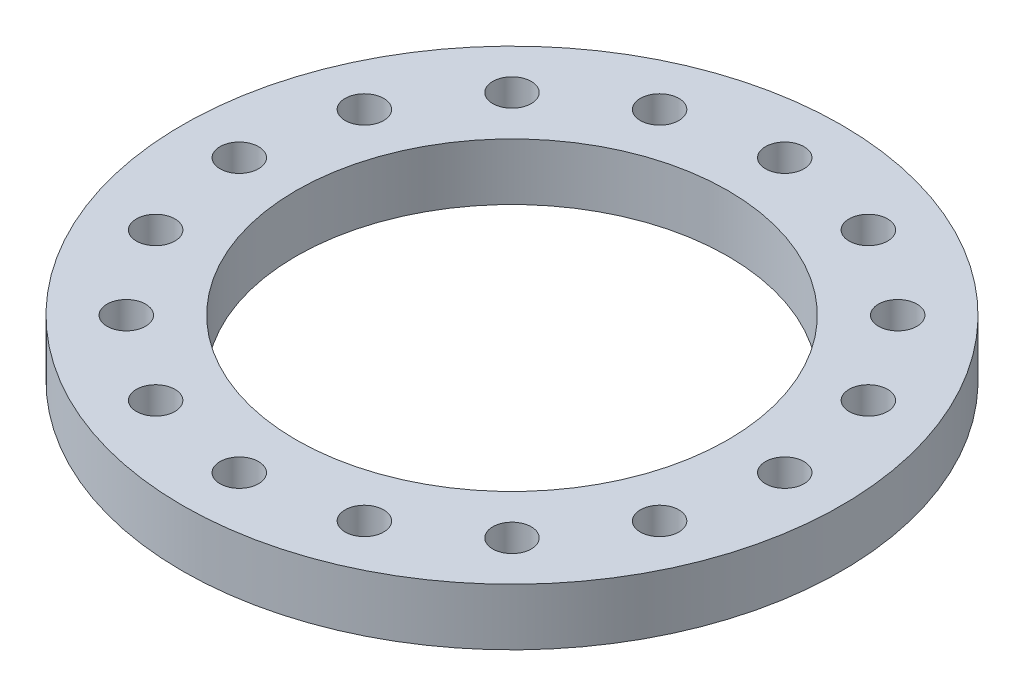
ISO-10303-21;
HEADER;
FILE_DESCRIPTION(('STEP AP214'),'2;1');
FILE_NAME('part.step','',(''),(''),'','','');
FILE_SCHEMA(('AUTOMOTIVE_DESIGN { 1 0 10303 214 1 1 1 1 }'));
ENDSEC;
DATA;
#1=APPLICATION_CONTEXT('core data for automotive mechanical design processes');
#2=APPLICATION_PROTOCOL_DEFINITION('international standard','automotive_design',2000,#1);
#3=PRODUCT_CONTEXT('',#1,'mechanical');
#4=PRODUCT('Part','Part','',(#3));
#5=PRODUCT_RELATED_PRODUCT_CATEGORY('part','',(#4));
#6=PRODUCT_DEFINITION_FORMATION('','',#4);
#7=PRODUCT_DEFINITION_CONTEXT('part definition',#1,'design');
#8=PRODUCT_DEFINITION('design','',#6,#7);
#9=PRODUCT_DEFINITION_SHAPE('','',#8);
#10=(LENGTH_UNIT() NAMED_UNIT(*) SI_UNIT(.MILLI.,.METRE.));
#11=(NAMED_UNIT(*) PLANE_ANGLE_UNIT() SI_UNIT($,.RADIAN.));
#12=(NAMED_UNIT(*) SI_UNIT($,.STERADIAN.) SOLID_ANGLE_UNIT());
#13=UNCERTAINTY_MEASURE_WITH_UNIT(LENGTH_MEASURE(1.E-05),#10,'distance_accuracy_value','');
#14=(GEOMETRIC_REPRESENTATION_CONTEXT(3) GLOBAL_UNCERTAINTY_ASSIGNED_CONTEXT((#13)) GLOBAL_UNIT_ASSIGNED_CONTEXT((#10,
#11,#12)) REPRESENTATION_CONTEXT('',''));
#15=CARTESIAN_POINT('',(0.,0.,0.));
#16=DIRECTION('',(0.,0.,1.));
#17=DIRECTION('',(1.,0.,0.));
#18=AXIS2_PLACEMENT_3D('',#15,#16,#17);
#19=CARTESIAN_POINT('',(0.,6.35,0.));
#20=DIRECTION('',(0.,1.,0.));
#21=DIRECTION('',(0.,0.,1.));
#22=AXIS2_PLACEMENT_3D('',#19,#20,#21);
#23=PLANE('',#22);
#24=CARTESIAN_POINT('',(-21.5526146905656,6.35,-21.5526146905651));
#25=DIRECTION('',(0.,1.,0.));
#26=DIRECTION('',(0.,0.,1.));
#27=AXIS2_PLACEMENT_3D('',#24,#25,#26);
#28=CIRCLE('',#27,2.15265);
#29=CARTESIAN_POINT('',(-21.5526146905656,6.35,-19.3999646905651));
#30=VERTEX_POINT('',#29);
#31=EDGE_CURVE('E133',#30,#30,#28,.T.);
#32=ORIENTED_EDGE('',*,*,#31,.F.);
#33=EDGE_LOOP('',(#32));
#34=FACE_BOUND('',#33,.T.);
#35=CARTESIAN_POINT('',(-30.4799999999987,6.35,1.29757419343617E-12));
#36=DIRECTION('',(0.,1.,0.));
#37=DIRECTION('',(0.,0.,1.));
#38=AXIS2_PLACEMENT_3D('',#35,#36,#37);
#39=CIRCLE('',#38,2.15265);
#40=CARTESIAN_POINT('',(-30.4799999999987,6.35,2.1526500000013));
#41=VERTEX_POINT('',#40);
#42=EDGE_CURVE('E121',#41,#41,#39,.T.);
#43=ORIENTED_EDGE('',*,*,#42,.F.);
#44=EDGE_LOOP('',(#43));
#45=FACE_BOUND('',#44,.T.);
#46=CARTESIAN_POINT('',(-21.5526146905638,6.35,21.5526146905669));
#47=DIRECTION('',(0.,1.,0.));
#48=DIRECTION('',(0.,0.,1.));
#49=AXIS2_PLACEMENT_3D('',#46,#47,#48);
#50=CIRCLE('',#49,2.15265);
#51=CARTESIAN_POINT('',(-21.5526146905638,6.35,23.7052646905669));
#52=VERTEX_POINT('',#51);
#53=EDGE_CURVE('E109',#52,#52,#50,.T.);
#54=ORIENTED_EDGE('',*,*,#53,.F.);
#55=EDGE_LOOP('',(#54));
#56=FACE_BOUND('',#55,.T.);
#57=CARTESIAN_POINT('',(2.5884605907022E-12,6.35,30.48));
#58=DIRECTION('',(0.,1.,0.));
#59=DIRECTION('',(0.,0.,1.));
#60=AXIS2_PLACEMENT_3D('',#57,#58,#59);
#61=CIRCLE('',#60,2.15265);
#62=CARTESIAN_POINT('',(2.5884605907022E-12,6.35,32.63265));
#63=VERTEX_POINT('',#62);
#64=EDGE_CURVE('E97',#63,#63,#61,.T.);
#65=ORIENTED_EDGE('',*,*,#64,.F.);
#66=EDGE_LOOP('',(#65));
#67=FACE_BOUND('',#66,.T.);
#68=CARTESIAN_POINT('',(21.5526146905682,6.35,21.5526146905651));
#69=DIRECTION('',(0.,1.,0.));
#70=DIRECTION('',(0.,0.,1.));
#71=AXIS2_PLACEMENT_3D('',#68,#69,#70);
#72=CIRCLE('',#71,2.15265);
#73=CARTESIAN_POINT('',(21.5526146905682,6.35,23.7052646905651));
#74=VERTEX_POINT('',#73);
#75=EDGE_CURVE('E85',#74,#74,#72,.T.);
#76=ORIENTED_EDGE('',*,*,#75,.F.);
#77=EDGE_LOOP('',(#76));
#78=FACE_BOUND('',#77,.T.);
#79=CARTESIAN_POINT('',(30.4800000000013,6.35,-1.29384146999237E-12));
#80=DIRECTION('',(0.,1.,0.));
#81=DIRECTION('',(0.,0.,1.));
#82=AXIS2_PLACEMENT_3D('',#79,#80,#81);
#83=CIRCLE('',#82,2.15265);
#84=CARTESIAN_POINT('',(30.4800000000013,6.35,2.15264999999871));
#85=VERTEX_POINT('',#84);
#86=EDGE_CURVE('E73',#85,#85,#83,.T.);
#87=ORIENTED_EDGE('',*,*,#86,.F.);
#88=EDGE_LOOP('',(#87));
#89=FACE_BOUND('',#88,.T.);
#90=CARTESIAN_POINT('',(21.5526146905664,6.35,-21.5526146905669));
#91=DIRECTION('',(0.,1.,0.));
#92=DIRECTION('',(0.,0.,1.));
#93=AXIS2_PLACEMENT_3D('',#90,#91,#92);
#94=CIRCLE('',#93,2.15265);
#95=CARTESIAN_POINT('',(21.5526146905664,6.35,-19.3999646905669));
#96=VERTEX_POINT('',#95);
#97=EDGE_CURVE('E61',#96,#96,#94,.T.);
#98=ORIENTED_EDGE('',*,*,#97,.F.);
#99=EDGE_LOOP('',(#98));
#100=FACE_BOUND('',#99,.T.);
#101=CARTESIAN_POINT('',(0.,6.35,-30.48));
#102=DIRECTION('',(0.,1.,0.));
#103=DIRECTION('',(0.,0.,1.));
#104=AXIS2_PLACEMENT_3D('',#101,#102,#103);
#105=CIRCLE('',#104,2.15265);
#106=CARTESIAN_POINT('',(0.,6.35,-28.32735));
#107=VERTEX_POINT('',#106);
#108=EDGE_CURVE('E49',#107,#107,#105,.T.);
#109=ORIENTED_EDGE('',*,*,#108,.F.);
#110=EDGE_LOOP('',(#109));
#111=FACE_BOUND('',#110,.T.);
#112=CARTESIAN_POINT('',(0.,6.35,0.));
#113=DIRECTION('',(0.,1.,0.));
#114=DIRECTION('',(0.,0.,1.));
#115=AXIS2_PLACEMENT_3D('',#112,#113,#114);
#116=CIRCLE('',#115,36.83);
#117=CARTESIAN_POINT('',(0.,6.35,36.83));
#118=VERTEX_POINT('',#117);
#119=EDGE_CURVE('E10',#118,#118,#116,.T.);
#120=ORIENTED_EDGE('',*,*,#119,.T.);
#121=EDGE_LOOP('',(#120));
#122=FACE_BOUND('',#121,.T.);
#123=CARTESIAN_POINT('',(0.,6.35,0.));
#124=DIRECTION('',(0.,1.,0.));
#125=DIRECTION('',(0.,0.,1.));
#126=AXIS2_PLACEMENT_3D('',#123,#124,#125);
#127=CIRCLE('',#126,24.13);
#128=CARTESIAN_POINT('',(0.,6.35,24.13));
#129=VERTEX_POINT('',#128);
#130=EDGE_CURVE('E44',#129,#129,#127,.T.);
#131=ORIENTED_EDGE('',*,*,#130,.F.);
#132=EDGE_LOOP('',(#131));
#133=FACE_BOUND('',#132,.T.);
#134=CARTESIAN_POINT('',(11.664191018488,6.35,-28.159848150944));
#135=DIRECTION('',(0.,1.,0.));
#136=DIRECTION('',(0.,0.,1.));
#137=AXIS2_PLACEMENT_3D('',#134,#135,#136);
#138=CIRCLE('',#137,2.15265);
#139=CARTESIAN_POINT('',(11.664191018488,6.35,-26.007198150944));
#140=VERTEX_POINT('',#139);
#141=EDGE_CURVE('E55',#140,#140,#138,.T.);
#142=ORIENTED_EDGE('',*,*,#141,.F.);
#143=EDGE_LOOP('',(#142));
#144=FACE_BOUND('',#143,.T.);
#145=CARTESIAN_POINT('',(28.1598481509448,6.35,-11.6641910184891));
#146=DIRECTION('',(0.,1.,0.));
#147=DIRECTION('',(0.,0.,1.));
#148=AXIS2_PLACEMENT_3D('',#145,#146,#147);
#149=CIRCLE('',#148,2.15265);
#150=CARTESIAN_POINT('',(28.1598481509448,6.35,-9.51154101848913));
#151=VERTEX_POINT('',#150);
#152=EDGE_CURVE('E67',#151,#151,#149,.T.);
#153=ORIENTED_EDGE('',*,*,#152,.F.);
#154=EDGE_LOOP('',(#153));
#155=FACE_BOUND('',#154,.T.);
#156=CARTESIAN_POINT('',(28.1598481509458,6.35,11.6641910184867));
#157=DIRECTION('',(0.,1.,0.));
#158=DIRECTION('',(0.,0.,1.));
#159=AXIS2_PLACEMENT_3D('',#156,#157,#158);
#160=CIRCLE('',#159,2.15265);
#161=CARTESIAN_POINT('',(28.1598481509458,6.35,13.8168410184867));
#162=VERTEX_POINT('',#161);
#163=EDGE_CURVE('E79',#162,#162,#160,.T.);
#164=ORIENTED_EDGE('',*,*,#163,.F.);
#165=EDGE_LOOP('',(#164));
#166=FACE_BOUND('',#165,.T.);
#167=CARTESIAN_POINT('',(11.6641910184904,6.35,28.1598481509435));
#168=DIRECTION('',(0.,1.,0.));
#169=DIRECTION('',(0.,0.,1.));
#170=AXIS2_PLACEMENT_3D('',#167,#168,#169);
#171=CIRCLE('',#170,2.15265);
#172=CARTESIAN_POINT('',(11.6641910184904,6.35,30.3124981509435));
#173=VERTEX_POINT('',#172);
#174=EDGE_CURVE('E91',#173,#173,#171,.T.);
#175=ORIENTED_EDGE('',*,*,#174,.F.);
#176=EDGE_LOOP('',(#175));
#177=FACE_BOUND('',#176,.T.);
#178=CARTESIAN_POINT('',(-11.6641910184854,6.35,28.1598481509445));
#179=DIRECTION('',(0.,1.,0.));
#180=DIRECTION('',(0.,0.,1.));
#181=AXIS2_PLACEMENT_3D('',#178,#179,#180);
#182=CIRCLE('',#181,2.15265);
#183=CARTESIAN_POINT('',(-11.6641910184854,6.35,30.3124981509445));
#184=VERTEX_POINT('',#183);
#185=EDGE_CURVE('E103',#184,#184,#182,.T.);
#186=ORIENTED_EDGE('',*,*,#185,.F.);
#187=EDGE_LOOP('',(#186));
#188=FACE_BOUND('',#187,.T.);
#189=CARTESIAN_POINT('',(-28.1598481509422,6.35,11.6641910184891));
#190=DIRECTION('',(0.,1.,0.));
#191=DIRECTION('',(0.,0.,1.));
#192=AXIS2_PLACEMENT_3D('',#189,#190,#191);
#193=CIRCLE('',#192,2.15265);
#194=CARTESIAN_POINT('',(-28.1598481509422,6.35,13.8168410184891));
#195=VERTEX_POINT('',#194);
#196=EDGE_CURVE('E115',#195,#195,#193,.T.);
#197=ORIENTED_EDGE('',*,*,#196,.F.);
#198=EDGE_LOOP('',(#197));
#199=FACE_BOUND('',#198,.T.);
#200=CARTESIAN_POINT('',(-28.1598481509432,6.35,-11.6641910184867));
#201=DIRECTION('',(0.,1.,0.));
#202=DIRECTION('',(0.,0.,1.));
#203=AXIS2_PLACEMENT_3D('',#200,#201,#202);
#204=CIRCLE('',#203,2.15265);
#205=CARTESIAN_POINT('',(-28.1598481509432,6.35,-9.51154101848675));
#206=VERTEX_POINT('',#205);
#207=EDGE_CURVE('E127',#206,#206,#204,.T.);
#208=ORIENTED_EDGE('',*,*,#207,.F.);
#209=EDGE_LOOP('',(#208));
#210=FACE_BOUND('',#209,.T.);
#211=CARTESIAN_POINT('',(-11.6641910184879,6.35,-28.1598481509435));
#212=DIRECTION('',(0.,1.,0.));
#213=DIRECTION('',(0.,0.,1.));
#214=AXIS2_PLACEMENT_3D('',#211,#212,#213);
#215=CIRCLE('',#214,2.15265000000048);
#216=CARTESIAN_POINT('',(-11.6641910184879,6.35,-26.007198150943));
#217=VERTEX_POINT('',#216);
#218=EDGE_CURVE('E139',#217,#217,#215,.T.);
#219=ORIENTED_EDGE('',*,*,#218,.F.);
#220=EDGE_LOOP('',(#219));
#221=FACE_BOUND('',#220,.T.);
#222=ADVANCED_FACE('F33',(#34,#45,#56,#67,#78,#89,#100,#111,#122,#133,#144,#155,#166,#177,#188,
#199,#210,#221),#23,.T.);
#223=CARTESIAN_POINT('',(0.,0.,0.));
#224=DIRECTION('',(0.,1.,0.));
#225=DIRECTION('',(0.,0.,1.));
#226=AXIS2_PLACEMENT_3D('',#223,#224,#225);
#227=PLANE('',#226);
#228=CARTESIAN_POINT('',(0.,0.,0.));
#229=DIRECTION('',(0.,1.,0.));
#230=DIRECTION('',(0.,0.,1.));
#231=AXIS2_PLACEMENT_3D('',#228,#229,#230);
#232=CIRCLE('',#231,36.83);
#233=CARTESIAN_POINT('',(0.,0.,36.83));
#234=VERTEX_POINT('',#233);
#235=EDGE_CURVE('E37',#234,#234,#232,.T.);
#236=ORIENTED_EDGE('',*,*,#235,.F.);
#237=EDGE_LOOP('',(#236));
#238=FACE_BOUND('',#237,.T.);
#239=CARTESIAN_POINT('',(0.,0.,0.));
#240=DIRECTION('',(0.,1.,0.));
#241=DIRECTION('',(0.,0.,1.));
#242=AXIS2_PLACEMENT_3D('',#239,#240,#241);
#243=CIRCLE('',#242,24.13);
#244=CARTESIAN_POINT('',(0.,0.,24.13));
#245=VERTEX_POINT('',#244);
#246=EDGE_CURVE('E46',#245,#245,#243,.T.);
#247=ORIENTED_EDGE('',*,*,#246,.T.);
#248=EDGE_LOOP('',(#247));
#249=FACE_BOUND('',#248,.T.);
#250=CARTESIAN_POINT('',(0.,0.,-30.48));
#251=DIRECTION('',(0.,1.,0.));
#252=DIRECTION('',(0.,0.,1.));
#253=AXIS2_PLACEMENT_3D('',#250,#251,#252);
#254=CIRCLE('',#253,2.15265);
#255=CARTESIAN_POINT('',(0.,0.,-28.32735));
#256=VERTEX_POINT('',#255);
#257=EDGE_CURVE('E52',#256,#256,#254,.T.);
#258=ORIENTED_EDGE('',*,*,#257,.T.);
#259=EDGE_LOOP('',(#258));
#260=FACE_BOUND('',#259,.T.);
#261=CARTESIAN_POINT('',(11.664191018488,0.,-28.159848150944));
#262=DIRECTION('',(0.,1.,0.));
#263=DIRECTION('',(0.,0.,1.));
#264=AXIS2_PLACEMENT_3D('',#261,#262,#263);
#265=CIRCLE('',#264,2.15265);
#266=CARTESIAN_POINT('',(11.664191018488,0.,-26.007198150944));
#267=VERTEX_POINT('',#266);
#268=EDGE_CURVE('E58',#267,#267,#265,.T.);
#269=ORIENTED_EDGE('',*,*,#268,.T.);
#270=EDGE_LOOP('',(#269));
#271=FACE_BOUND('',#270,.T.);
#272=CARTESIAN_POINT('',(21.5526146905664,0.,-21.5526146905669));
#273=DIRECTION('',(0.,1.,0.));
#274=DIRECTION('',(0.,0.,1.));
#275=AXIS2_PLACEMENT_3D('',#272,#273,#274);
#276=CIRCLE('',#275,2.15265);
#277=CARTESIAN_POINT('',(21.5526146905664,0.,-19.3999646905669));
#278=VERTEX_POINT('',#277);
#279=EDGE_CURVE('E64',#278,#278,#276,.T.);
#280=ORIENTED_EDGE('',*,*,#279,.T.);
#281=EDGE_LOOP('',(#280));
#282=FACE_BOUND('',#281,.T.);
#283=CARTESIAN_POINT('',(28.1598481509448,0.,-11.6641910184891));
#284=DIRECTION('',(0.,1.,0.));
#285=DIRECTION('',(0.,0.,1.));
#286=AXIS2_PLACEMENT_3D('',#283,#284,#285);
#287=CIRCLE('',#286,2.15265);
#288=CARTESIAN_POINT('',(28.1598481509448,0.,-9.51154101848913));
#289=VERTEX_POINT('',#288);
#290=EDGE_CURVE('E70',#289,#289,#287,.T.);
#291=ORIENTED_EDGE('',*,*,#290,.T.);
#292=EDGE_LOOP('',(#291));
#293=FACE_BOUND('',#292,.T.);
#294=CARTESIAN_POINT('',(30.4800000000013,0.,-1.29384146999237E-12));
#295=DIRECTION('',(0.,1.,0.));
#296=DIRECTION('',(0.,0.,1.));
#297=AXIS2_PLACEMENT_3D('',#294,#295,#296);
#298=CIRCLE('',#297,2.15265);
#299=CARTESIAN_POINT('',(30.4800000000013,0.,2.15264999999871));
#300=VERTEX_POINT('',#299);
#301=EDGE_CURVE('E76',#300,#300,#298,.T.);
#302=ORIENTED_EDGE('',*,*,#301,.T.);
#303=EDGE_LOOP('',(#302));
#304=FACE_BOUND('',#303,.T.);
#305=CARTESIAN_POINT('',(28.1598481509458,0.,11.6641910184867));
#306=DIRECTION('',(0.,1.,0.));
#307=DIRECTION('',(0.,0.,1.));
#308=AXIS2_PLACEMENT_3D('',#305,#306,#307);
#309=CIRCLE('',#308,2.15265);
#310=CARTESIAN_POINT('',(28.1598481509458,0.,13.8168410184867));
#311=VERTEX_POINT('',#310);
#312=EDGE_CURVE('E82',#311,#311,#309,.T.);
#313=ORIENTED_EDGE('',*,*,#312,.T.);
#314=EDGE_LOOP('',(#313));
#315=FACE_BOUND('',#314,.T.);
#316=CARTESIAN_POINT('',(21.5526146905682,0.,21.5526146905651));
#317=DIRECTION('',(0.,1.,0.));
#318=DIRECTION('',(0.,0.,1.));
#319=AXIS2_PLACEMENT_3D('',#316,#317,#318);
#320=CIRCLE('',#319,2.15265);
#321=CARTESIAN_POINT('',(21.5526146905682,0.,23.7052646905651));
#322=VERTEX_POINT('',#321);
#323=EDGE_CURVE('E88',#322,#322,#320,.T.);
#324=ORIENTED_EDGE('',*,*,#323,.T.);
#325=EDGE_LOOP('',(#324));
#326=FACE_BOUND('',#325,.T.);
#327=CARTESIAN_POINT('',(11.6641910184904,0.,28.1598481509435));
#328=DIRECTION('',(0.,1.,0.));
#329=DIRECTION('',(0.,0.,1.));
#330=AXIS2_PLACEMENT_3D('',#327,#328,#329);
#331=CIRCLE('',#330,2.15265);
#332=CARTESIAN_POINT('',(11.6641910184904,0.,30.3124981509435));
#333=VERTEX_POINT('',#332);
#334=EDGE_CURVE('E94',#333,#333,#331,.T.);
#335=ORIENTED_EDGE('',*,*,#334,.T.);
#336=EDGE_LOOP('',(#335));
#337=FACE_BOUND('',#336,.T.);
#338=CARTESIAN_POINT('',(2.5884605907022E-12,0.,30.48));
#339=DIRECTION('',(0.,1.,0.));
#340=DIRECTION('',(0.,0.,1.));
#341=AXIS2_PLACEMENT_3D('',#338,#339,#340);
#342=CIRCLE('',#341,2.15265);
#343=CARTESIAN_POINT('',(2.5884605907022E-12,0.,32.63265));
#344=VERTEX_POINT('',#343);
#345=EDGE_CURVE('E100',#344,#344,#342,.T.);
#346=ORIENTED_EDGE('',*,*,#345,.T.);
#347=EDGE_LOOP('',(#346));
#348=FACE_BOUND('',#347,.T.);
#349=CARTESIAN_POINT('',(-11.6641910184854,0.,28.1598481509445));
#350=DIRECTION('',(0.,1.,0.));
#351=DIRECTION('',(0.,0.,1.));
#352=AXIS2_PLACEMENT_3D('',#349,#350,#351);
#353=CIRCLE('',#352,2.15265);
#354=CARTESIAN_POINT('',(-11.6641910184854,0.,30.3124981509445));
#355=VERTEX_POINT('',#354);
#356=EDGE_CURVE('E106',#355,#355,#353,.T.);
#357=ORIENTED_EDGE('',*,*,#356,.T.);
#358=EDGE_LOOP('',(#357));
#359=FACE_BOUND('',#358,.T.);
#360=CARTESIAN_POINT('',(-21.5526146905638,0.,21.5526146905669));
#361=DIRECTION('',(0.,1.,0.));
#362=DIRECTION('',(0.,0.,1.));
#363=AXIS2_PLACEMENT_3D('',#360,#361,#362);
#364=CIRCLE('',#363,2.15265);
#365=CARTESIAN_POINT('',(-21.5526146905638,0.,23.7052646905669));
#366=VERTEX_POINT('',#365);
#367=EDGE_CURVE('E112',#366,#366,#364,.T.);
#368=ORIENTED_EDGE('',*,*,#367,.T.);
#369=EDGE_LOOP('',(#368));
#370=FACE_BOUND('',#369,.T.);
#371=CARTESIAN_POINT('',(-28.1598481509422,0.,11.6641910184891));
#372=DIRECTION('',(0.,1.,0.));
#373=DIRECTION('',(0.,0.,1.));
#374=AXIS2_PLACEMENT_3D('',#371,#372,#373);
#375=CIRCLE('',#374,2.15265);
#376=CARTESIAN_POINT('',(-28.1598481509422,0.,13.8168410184891));
#377=VERTEX_POINT('',#376);
#378=EDGE_CURVE('E118',#377,#377,#375,.T.);
#379=ORIENTED_EDGE('',*,*,#378,.T.);
#380=EDGE_LOOP('',(#379));
#381=FACE_BOUND('',#380,.T.);
#382=CARTESIAN_POINT('',(-30.4799999999987,0.,1.29757419343617E-12));
#383=DIRECTION('',(0.,1.,0.));
#384=DIRECTION('',(0.,0.,1.));
#385=AXIS2_PLACEMENT_3D('',#382,#383,#384);
#386=CIRCLE('',#385,2.15265);
#387=CARTESIAN_POINT('',(-30.4799999999987,0.,2.1526500000013));
#388=VERTEX_POINT('',#387);
#389=EDGE_CURVE('E124',#388,#388,#386,.T.);
#390=ORIENTED_EDGE('',*,*,#389,.T.);
#391=EDGE_LOOP('',(#390));
#392=FACE_BOUND('',#391,.T.);
#393=CARTESIAN_POINT('',(-28.1598481509432,0.,-11.6641910184867));
#394=DIRECTION('',(0.,1.,0.));
#395=DIRECTION('',(0.,0.,1.));
#396=AXIS2_PLACEMENT_3D('',#393,#394,#395);
#397=CIRCLE('',#396,2.15265);
#398=CARTESIAN_POINT('',(-28.1598481509432,0.,-9.51154101848675));
#399=VERTEX_POINT('',#398);
#400=EDGE_CURVE('E130',#399,#399,#397,.T.);
#401=ORIENTED_EDGE('',*,*,#400,.T.);
#402=EDGE_LOOP('',(#401));
#403=FACE_BOUND('',#402,.T.);
#404=CARTESIAN_POINT('',(-21.5526146905656,0.,-21.5526146905651));
#405=DIRECTION('',(0.,1.,0.));
#406=DIRECTION('',(0.,0.,1.));
#407=AXIS2_PLACEMENT_3D('',#404,#405,#406);
#408=CIRCLE('',#407,2.15265);
#409=CARTESIAN_POINT('',(-21.5526146905656,0.,-19.3999646905651));
#410=VERTEX_POINT('',#409);
#411=EDGE_CURVE('E136',#410,#410,#408,.T.);
#412=ORIENTED_EDGE('',*,*,#411,.T.);
#413=EDGE_LOOP('',(#412));
#414=FACE_BOUND('',#413,.T.);
#415=CARTESIAN_POINT('',(-11.6641910184879,0.,-28.1598481509435));
#416=DIRECTION('',(0.,1.,0.));
#417=DIRECTION('',(0.,0.,1.));
#418=AXIS2_PLACEMENT_3D('',#415,#416,#417);
#419=CIRCLE('',#418,2.15265000000048);
#420=CARTESIAN_POINT('',(-11.6641910184879,0.,-26.007198150943));
#421=VERTEX_POINT('',#420);
#422=EDGE_CURVE('E142',#421,#421,#419,.T.);
#423=ORIENTED_EDGE('',*,*,#422,.T.);
#424=EDGE_LOOP('',(#423));
#425=FACE_BOUND('',#424,.T.);
#426=ADVANCED_FACE('F152',(#238,#249,#260,#271,#282,#293,#304,#315,#326,#337,#348,#359,#370,
#381,#392,#403,#414,#425),#227,.F.);
#427=CARTESIAN_POINT('',(0.,6.35,0.));
#428=DIRECTION('',(0.,-1.,0.));
#429=DIRECTION('',(0.,0.,-1.));
#430=AXIS2_PLACEMENT_3D('',#427,#428,#429);
#431=CYLINDRICAL_SURFACE('',#430,36.83);
#432=ORIENTED_EDGE('',*,*,#119,.F.);
#433=EDGE_LOOP('',(#432));
#434=FACE_BOUND('',#433,.T.);
#435=ORIENTED_EDGE('',*,*,#235,.T.);
#436=EDGE_LOOP('',(#435));
#437=FACE_BOUND('',#436,.T.);
#438=ADVANCED_FACE('F35',(#434,#437),#431,.T.);
#439=CARTESIAN_POINT('',(0.,6.35,0.));
#440=DIRECTION('',(0.,-1.,0.));
#441=DIRECTION('',(0.,0.,-1.));
#442=AXIS2_PLACEMENT_3D('',#439,#440,#441);
#443=CYLINDRICAL_SURFACE('',#442,24.13);
#444=ORIENTED_EDGE('',*,*,#130,.T.);
#445=EDGE_LOOP('',(#444));
#446=FACE_BOUND('',#445,.T.);
#447=ORIENTED_EDGE('',*,*,#246,.F.);
#448=EDGE_LOOP('',(#447));
#449=FACE_BOUND('',#448,.T.);
#450=ADVANCED_FACE('F162',(#446,#449),#443,.F.);
#451=CARTESIAN_POINT('',(0.,6.35,-30.48));
#452=DIRECTION('',(0.,-1.,0.));
#453=DIRECTION('',(0.,0.,-1.));
#454=AXIS2_PLACEMENT_3D('',#451,#452,#453);
#455=CYLINDRICAL_SURFACE('',#454,2.15265);
#456=ORIENTED_EDGE('',*,*,#108,.T.);
#457=EDGE_LOOP('',(#456));
#458=FACE_BOUND('',#457,.T.);
#459=ORIENTED_EDGE('',*,*,#257,.F.);
#460=EDGE_LOOP('',(#459));
#461=FACE_BOUND('',#460,.T.);
#462=ADVANCED_FACE('F165',(#458,#461),#455,.F.);
#463=CARTESIAN_POINT('',(11.664191018488,6.35,-28.159848150944));
#464=DIRECTION('',(0.,-1.,0.));
#465=DIRECTION('',(0.,0.,-1.));
#466=AXIS2_PLACEMENT_3D('',#463,#464,#465);
#467=CYLINDRICAL_SURFACE('',#466,2.15265);
#468=ORIENTED_EDGE('',*,*,#141,.T.);
#469=EDGE_LOOP('',(#468));
#470=FACE_BOUND('',#469,.T.);
#471=ORIENTED_EDGE('',*,*,#268,.F.);
#472=EDGE_LOOP('',(#471));
#473=FACE_BOUND('',#472,.T.);
#474=ADVANCED_FACE('F169',(#470,#473),#467,.F.);
#475=CARTESIAN_POINT('',(21.5526146905664,6.35,-21.5526146905669));
#476=DIRECTION('',(0.,-1.,0.));
#477=DIRECTION('',(0.,0.,-1.));
#478=AXIS2_PLACEMENT_3D('',#475,#476,#477);
#479=CYLINDRICAL_SURFACE('',#478,2.15265);
#480=ORIENTED_EDGE('',*,*,#97,.T.);
#481=EDGE_LOOP('',(#480));
#482=FACE_BOUND('',#481,.T.);
#483=ORIENTED_EDGE('',*,*,#279,.F.);
#484=EDGE_LOOP('',(#483));
#485=FACE_BOUND('',#484,.T.);
#486=ADVANCED_FACE('F173',(#482,#485),#479,.F.);
#487=CARTESIAN_POINT('',(28.1598481509448,6.35,-11.6641910184891));
#488=DIRECTION('',(0.,-1.,0.));
#489=DIRECTION('',(0.,0.,-1.));
#490=AXIS2_PLACEMENT_3D('',#487,#488,#489);
#491=CYLINDRICAL_SURFACE('',#490,2.15265);
#492=ORIENTED_EDGE('',*,*,#152,.T.);
#493=EDGE_LOOP('',(#492));
#494=FACE_BOUND('',#493,.T.);
#495=ORIENTED_EDGE('',*,*,#290,.F.);
#496=EDGE_LOOP('',(#495));
#497=FACE_BOUND('',#496,.T.);
#498=ADVANCED_FACE('F177',(#494,#497),#491,.F.);
#499=CARTESIAN_POINT('',(30.4800000000013,6.35,-1.29384146999237E-12));
#500=DIRECTION('',(0.,-1.,0.));
#501=DIRECTION('',(0.,0.,-1.));
#502=AXIS2_PLACEMENT_3D('',#499,#500,#501);
#503=CYLINDRICAL_SURFACE('',#502,2.15265);
#504=ORIENTED_EDGE('',*,*,#86,.T.);
#505=EDGE_LOOP('',(#504));
#506=FACE_BOUND('',#505,.T.);
#507=ORIENTED_EDGE('',*,*,#301,.F.);
#508=EDGE_LOOP('',(#507));
#509=FACE_BOUND('',#508,.T.);
#510=ADVANCED_FACE('F181',(#506,#509),#503,.F.);
#511=CARTESIAN_POINT('',(28.1598481509458,6.35,11.6641910184867));
#512=DIRECTION('',(0.,-1.,0.));
#513=DIRECTION('',(0.,0.,-1.));
#514=AXIS2_PLACEMENT_3D('',#511,#512,#513);
#515=CYLINDRICAL_SURFACE('',#514,2.15265);
#516=ORIENTED_EDGE('',*,*,#163,.T.);
#517=EDGE_LOOP('',(#516));
#518=FACE_BOUND('',#517,.T.);
#519=ORIENTED_EDGE('',*,*,#312,.F.);
#520=EDGE_LOOP('',(#519));
#521=FACE_BOUND('',#520,.T.);
#522=ADVANCED_FACE('F185',(#518,#521),#515,.F.);
#523=CARTESIAN_POINT('',(21.5526146905682,6.35,21.5526146905651));
#524=DIRECTION('',(0.,-1.,0.));
#525=DIRECTION('',(0.,0.,-1.));
#526=AXIS2_PLACEMENT_3D('',#523,#524,#525);
#527=CYLINDRICAL_SURFACE('',#526,2.15265);
#528=ORIENTED_EDGE('',*,*,#75,.T.);
#529=EDGE_LOOP('',(#528));
#530=FACE_BOUND('',#529,.T.);
#531=ORIENTED_EDGE('',*,*,#323,.F.);
#532=EDGE_LOOP('',(#531));
#533=FACE_BOUND('',#532,.T.);
#534=ADVANCED_FACE('F189',(#530,#533),#527,.F.);
#535=CARTESIAN_POINT('',(11.6641910184904,6.35,28.1598481509435));
#536=DIRECTION('',(0.,-1.,0.));
#537=DIRECTION('',(0.,0.,-1.));
#538=AXIS2_PLACEMENT_3D('',#535,#536,#537);
#539=CYLINDRICAL_SURFACE('',#538,2.15265);
#540=ORIENTED_EDGE('',*,*,#174,.T.);
#541=EDGE_LOOP('',(#540));
#542=FACE_BOUND('',#541,.T.);
#543=ORIENTED_EDGE('',*,*,#334,.F.);
#544=EDGE_LOOP('',(#543));
#545=FACE_BOUND('',#544,.T.);
#546=ADVANCED_FACE('F193',(#542,#545),#539,.F.);
#547=CARTESIAN_POINT('',(2.5884605907022E-12,6.35,30.48));
#548=DIRECTION('',(0.,-1.,0.));
#549=DIRECTION('',(0.,0.,-1.));
#550=AXIS2_PLACEMENT_3D('',#547,#548,#549);
#551=CYLINDRICAL_SURFACE('',#550,2.15265);
#552=ORIENTED_EDGE('',*,*,#64,.T.);
#553=EDGE_LOOP('',(#552));
#554=FACE_BOUND('',#553,.T.);
#555=ORIENTED_EDGE('',*,*,#345,.F.);
#556=EDGE_LOOP('',(#555));
#557=FACE_BOUND('',#556,.T.);
#558=ADVANCED_FACE('F197',(#554,#557),#551,.F.);
#559=CARTESIAN_POINT('',(-11.6641910184854,6.35,28.1598481509445));
#560=DIRECTION('',(0.,-1.,0.));
#561=DIRECTION('',(0.,0.,-1.));
#562=AXIS2_PLACEMENT_3D('',#559,#560,#561);
#563=CYLINDRICAL_SURFACE('',#562,2.15265);
#564=ORIENTED_EDGE('',*,*,#185,.T.);
#565=EDGE_LOOP('',(#564));
#566=FACE_BOUND('',#565,.T.);
#567=ORIENTED_EDGE('',*,*,#356,.F.);
#568=EDGE_LOOP('',(#567));
#569=FACE_BOUND('',#568,.T.);
#570=ADVANCED_FACE('F201',(#566,#569),#563,.F.);
#571=CARTESIAN_POINT('',(-21.5526146905638,6.35,21.5526146905669));
#572=DIRECTION('',(0.,-1.,0.));
#573=DIRECTION('',(0.,0.,-1.));
#574=AXIS2_PLACEMENT_3D('',#571,#572,#573);
#575=CYLINDRICAL_SURFACE('',#574,2.15265);
#576=ORIENTED_EDGE('',*,*,#53,.T.);
#577=EDGE_LOOP('',(#576));
#578=FACE_BOUND('',#577,.T.);
#579=ORIENTED_EDGE('',*,*,#367,.F.);
#580=EDGE_LOOP('',(#579));
#581=FACE_BOUND('',#580,.T.);
#582=ADVANCED_FACE('F205',(#578,#581),#575,.F.);
#583=CARTESIAN_POINT('',(-28.1598481509422,6.35,11.6641910184891));
#584=DIRECTION('',(0.,-1.,0.));
#585=DIRECTION('',(0.,0.,-1.));
#586=AXIS2_PLACEMENT_3D('',#583,#584,#585);
#587=CYLINDRICAL_SURFACE('',#586,2.15265);
#588=ORIENTED_EDGE('',*,*,#196,.T.);
#589=EDGE_LOOP('',(#588));
#590=FACE_BOUND('',#589,.T.);
#591=ORIENTED_EDGE('',*,*,#378,.F.);
#592=EDGE_LOOP('',(#591));
#593=FACE_BOUND('',#592,.T.);
#594=ADVANCED_FACE('F209',(#590,#593),#587,.F.);
#595=CARTESIAN_POINT('',(-30.4799999999987,6.35,1.29757419343617E-12));
#596=DIRECTION('',(0.,-1.,0.));
#597=DIRECTION('',(0.,0.,-1.));
#598=AXIS2_PLACEMENT_3D('',#595,#596,#597);
#599=CYLINDRICAL_SURFACE('',#598,2.15265);
#600=ORIENTED_EDGE('',*,*,#42,.T.);
#601=EDGE_LOOP('',(#600));
#602=FACE_BOUND('',#601,.T.);
#603=ORIENTED_EDGE('',*,*,#389,.F.);
#604=EDGE_LOOP('',(#603));
#605=FACE_BOUND('',#604,.T.);
#606=ADVANCED_FACE('F213',(#602,#605),#599,.F.);
#607=CARTESIAN_POINT('',(-28.1598481509432,6.35,-11.6641910184867));
#608=DIRECTION('',(0.,-1.,0.));
#609=DIRECTION('',(0.,0.,-1.));
#610=AXIS2_PLACEMENT_3D('',#607,#608,#609);
#611=CYLINDRICAL_SURFACE('',#610,2.15265);
#612=ORIENTED_EDGE('',*,*,#207,.T.);
#613=EDGE_LOOP('',(#612));
#614=FACE_BOUND('',#613,.T.);
#615=ORIENTED_EDGE('',*,*,#400,.F.);
#616=EDGE_LOOP('',(#615));
#617=FACE_BOUND('',#616,.T.);
#618=ADVANCED_FACE('F217',(#614,#617),#611,.F.);
#619=CARTESIAN_POINT('',(-21.5526146905656,6.35,-21.5526146905651));
#620=DIRECTION('',(0.,-1.,0.));
#621=DIRECTION('',(0.,0.,-1.));
#622=AXIS2_PLACEMENT_3D('',#619,#620,#621);
#623=CYLINDRICAL_SURFACE('',#622,2.15265);
#624=ORIENTED_EDGE('',*,*,#31,.T.);
#625=EDGE_LOOP('',(#624));
#626=FACE_BOUND('',#625,.T.);
#627=ORIENTED_EDGE('',*,*,#411,.F.);
#628=EDGE_LOOP('',(#627));
#629=FACE_BOUND('',#628,.T.);
#630=ADVANCED_FACE('F221',(#626,#629),#623,.F.);
#631=CARTESIAN_POINT('',(-11.6641910184879,6.35,-28.1598481509435));
#632=DIRECTION('',(0.,-1.,0.));
#633=DIRECTION('',(0.,0.,-1.));
#634=AXIS2_PLACEMENT_3D('',#631,#632,#633);
#635=CYLINDRICAL_SURFACE('',#634,2.15265000000048);
#636=ORIENTED_EDGE('',*,*,#218,.T.);
#637=EDGE_LOOP('',(#636));
#638=FACE_BOUND('',#637,.T.);
#639=ORIENTED_EDGE('',*,*,#422,.F.);
#640=EDGE_LOOP('',(#639));
#641=FACE_BOUND('',#640,.T.);
#642=ADVANCED_FACE('F148',(#638,#641),#635,.F.);
#643=CLOSED_SHELL('',(#222,#426,#438,#450,#462,#474,#486,#498,#510,#522,#534,#546,#558,#570,
#582,#594,#606,#618,#630,#642));
#644=MANIFOLD_SOLID_BREP('B2',#643);
#645=ADVANCED_BREP_SHAPE_REPRESENTATION('',(#18,#644),#14);
#646=SHAPE_DEFINITION_REPRESENTATION(#9,#645);
ENDSEC;
END-ISO-10303-21;
